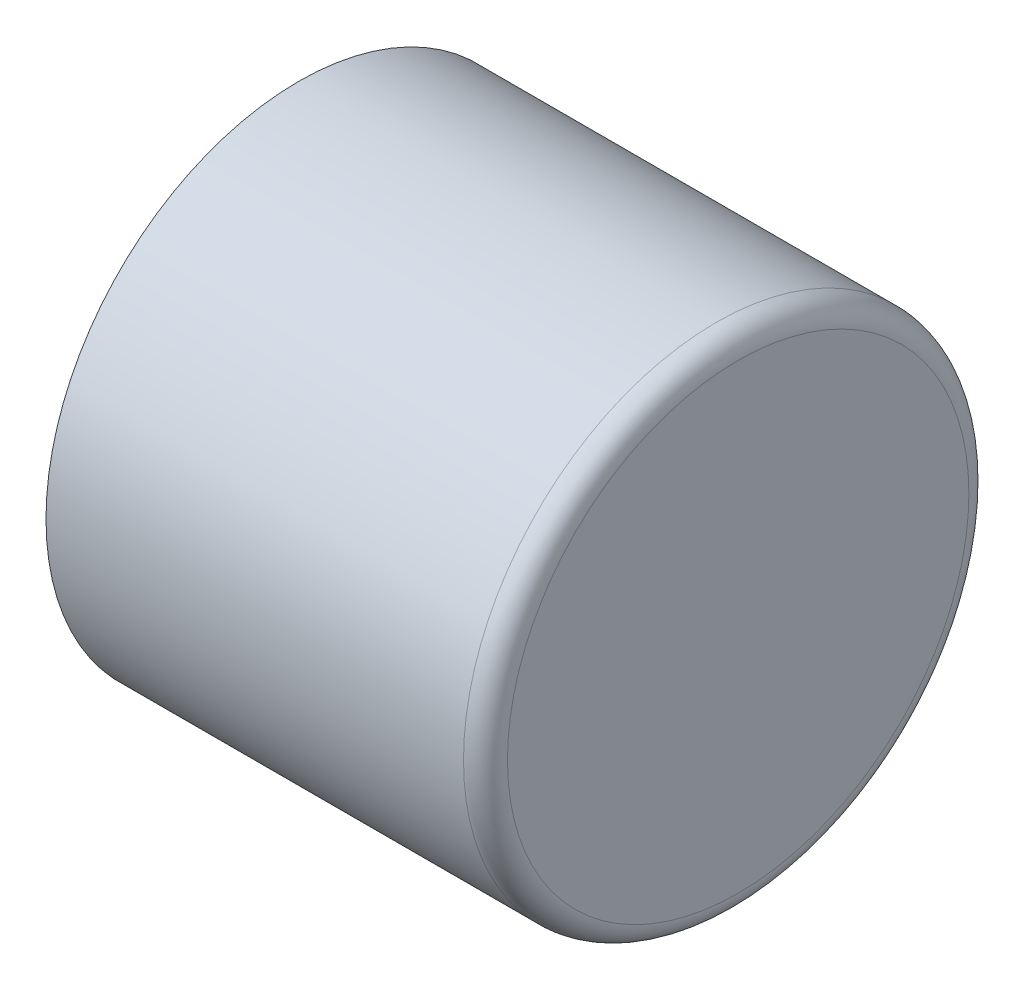
ISO-10303-21;
HEADER;
FILE_DESCRIPTION(('STEP AP214'),'2;1');
FILE_NAME('part.step','',(''),(''),'','','');
FILE_SCHEMA(('AUTOMOTIVE_DESIGN { 1 0 10303 214 1 1 1 1 }'));
ENDSEC;
DATA;
#1=APPLICATION_CONTEXT('core data for automotive mechanical design processes');
#2=APPLICATION_PROTOCOL_DEFINITION('international standard','automotive_design',2000,#1);
#3=PRODUCT_CONTEXT('',#1,'mechanical');
#4=PRODUCT('Part','Part','',(#3));
#5=PRODUCT_RELATED_PRODUCT_CATEGORY('part','',(#4));
#6=PRODUCT_DEFINITION_FORMATION('','',#4);
#7=PRODUCT_DEFINITION_CONTEXT('part definition',#1,'design');
#8=PRODUCT_DEFINITION('design','',#6,#7);
#9=PRODUCT_DEFINITION_SHAPE('','',#8);
#10=(LENGTH_UNIT() NAMED_UNIT(*) SI_UNIT(.MILLI.,.METRE.));
#11=(NAMED_UNIT(*) PLANE_ANGLE_UNIT() SI_UNIT($,.RADIAN.));
#12=(NAMED_UNIT(*) SI_UNIT($,.STERADIAN.) SOLID_ANGLE_UNIT());
#13=UNCERTAINTY_MEASURE_WITH_UNIT(LENGTH_MEASURE(1.E-05),#10,'distance_accuracy_value','');
#14=(GEOMETRIC_REPRESENTATION_CONTEXT(3) GLOBAL_UNCERTAINTY_ASSIGNED_CONTEXT((#13)) GLOBAL_UNIT_ASSIGNED_CONTEXT((#10,
#11,#12)) REPRESENTATION_CONTEXT('',''));
#15=CARTESIAN_POINT('',(0.,0.,0.));
#16=DIRECTION('',(0.,0.,1.));
#17=DIRECTION('',(1.,0.,0.));
#18=AXIS2_PLACEMENT_3D('',#15,#16,#17);
#19=CARTESIAN_POINT('',(25.4,0.,0.));
#20=DIRECTION('',(-1.,0.,0.));
#21=DIRECTION('',(0.,0.,1.));
#22=AXIS2_PLACEMENT_3D('',#19,#20,#21);
#23=CYLINDRICAL_SURFACE('',#22,12.7);
#24=CARTESIAN_POINT('',(0.,0.,0.));
#25=DIRECTION('',(1.,0.,0.));
#26=DIRECTION('',(0.,0.,-1.));
#27=AXIS2_PLACEMENT_3D('',#24,#25,#26);
#28=CIRCLE('',#27,12.7);
#29=CARTESIAN_POINT('',(0.,0.,-12.7));
#30=VERTEX_POINT('',#29);
#31=EDGE_CURVE('E55',#30,#30,#28,.T.);
#32=ORIENTED_EDGE('',*,*,#31,.F.);
#33=EDGE_LOOP('',(#32));
#34=FACE_BOUND('',#33,.T.);
#35=CARTESIAN_POINT('',(24.13,0.,0.));
#36=DIRECTION('',(1.,0.,0.));
#37=DIRECTION('',(0.,0.,-1.));
#38=AXIS2_PLACEMENT_3D('',#35,#36,#37);
#39=CIRCLE('',#38,12.7);
#40=CARTESIAN_POINT('',(24.13,0.,-12.7));
#41=VERTEX_POINT('',#40);
#42=EDGE_CURVE('E61',#41,#41,#39,.T.);
#43=ORIENTED_EDGE('',*,*,#42,.T.);
#44=EDGE_LOOP('',(#43));
#45=FACE_BOUND('',#44,.T.);
#46=ADVANCED_FACE('F37',(#34,#45),#23,.F.);
#47=CARTESIAN_POINT('',(25.4,0.,0.));
#48=DIRECTION('',(1.,0.,0.));
#49=DIRECTION('',(0.,0.,-1.));
#50=AXIS2_PLACEMENT_3D('',#47,#48,#49);
#51=PLANE('',#50);
#52=CARTESIAN_POINT('',(25.4,0.,0.));
#53=DIRECTION('',(1.,0.,0.));
#54=DIRECTION('',(0.,0.,-1.));
#55=AXIS2_PLACEMENT_3D('',#52,#53,#54);
#56=CIRCLE('',#55,13.335);
#57=CARTESIAN_POINT('',(25.4,0.,-13.335));
#58=VERTEX_POINT('',#57);
#59=EDGE_CURVE('E45',#58,#58,#56,.T.);
#60=ORIENTED_EDGE('',*,*,#59,.T.);
#61=EDGE_LOOP('',(#60));
#62=FACE_BOUND('',#61,.T.);
#63=ADVANCED_FACE('F77',(#62),#51,.T.);
#64=CARTESIAN_POINT('',(0.,0.,0.));
#65=DIRECTION('',(1.,0.,0.));
#66=DIRECTION('',(0.,0.,-1.));
#67=AXIS2_PLACEMENT_3D('',#64,#65,#66);
#68=PLANE('',#67);
#69=CARTESIAN_POINT('',(0.,0.,0.));
#70=DIRECTION('',(1.,0.,0.));
#71=DIRECTION('',(0.,0.,-1.));
#72=AXIS2_PLACEMENT_3D('',#69,#70,#71);
#73=CIRCLE('',#72,14.605);
#74=CARTESIAN_POINT('',(0.,0.,-14.605));
#75=VERTEX_POINT('',#74);
#76=EDGE_CURVE('E50',#75,#75,#73,.T.);
#77=ORIENTED_EDGE('',*,*,#76,.F.);
#78=EDGE_LOOP('',(#77));
#79=FACE_BOUND('',#78,.T.);
#80=ORIENTED_EDGE('',*,*,#31,.T.);
#81=EDGE_LOOP('',(#80));
#82=FACE_BOUND('',#81,.T.);
#83=ADVANCED_FACE('F82',(#79,#82),#68,.F.);
#84=CARTESIAN_POINT('',(25.4,0.,0.));
#85=DIRECTION('',(-1.,0.,0.));
#86=DIRECTION('',(0.,0.,1.));
#87=AXIS2_PLACEMENT_3D('',#84,#85,#86);
#88=CYLINDRICAL_SURFACE('',#87,14.605);
#89=CARTESIAN_POINT('',(24.13,0.,0.));
#90=DIRECTION('',(1.,0.,0.));
#91=DIRECTION('',(0.,0.,-1.));
#92=AXIS2_PLACEMENT_3D('',#89,#90,#91);
#93=CIRCLE('',#92,14.605);
#94=CARTESIAN_POINT('',(24.13,0.,-14.605));
#95=VERTEX_POINT('',#94);
#96=EDGE_CURVE('E10',#95,#95,#93,.F.);
#97=ORIENTED_EDGE('',*,*,#96,.T.);
#98=EDGE_LOOP('',(#97));
#99=FACE_BOUND('',#98,.T.);
#100=ORIENTED_EDGE('',*,*,#76,.T.);
#101=EDGE_LOOP('',(#100));
#102=FACE_BOUND('',#101,.T.);
#103=ADVANCED_FACE('F73',(#99,#102),#88,.T.);
#104=CARTESIAN_POINT('',(24.13,0.,0.));
#105=DIRECTION('',(1.,0.,0.));
#106=DIRECTION('',(0.,0.,-1.));
#107=AXIS2_PLACEMENT_3D('',#104,#105,#106);
#108=TOROIDAL_SURFACE('',#107,13.335,1.27);
#109=ORIENTED_EDGE('',*,*,#96,.F.);
#110=EDGE_LOOP('',(#109));
#111=FACE_BOUND('',#110,.T.);
#112=ORIENTED_EDGE('',*,*,#59,.F.);
#113=EDGE_LOOP('',(#112));
#114=FACE_BOUND('',#113,.T.);
#115=ADVANCED_FACE('F39',(#111,#114),#108,.T.);
#116=CARTESIAN_POINT('',(24.13,0.,0.));
#117=DIRECTION('',(1.,0.,0.));
#118=DIRECTION('',(0.,0.,-1.));
#119=AXIS2_PLACEMENT_3D('',#116,#117,#118);
#120=PLANE('',#119);
#121=ORIENTED_EDGE('',*,*,#42,.F.);
#122=EDGE_LOOP('',(#121));
#123=FACE_BOUND('',#122,.T.);
#124=ADVANCED_FACE('F67',(#123),#120,.F.);
#125=CLOSED_SHELL('',(#46,#63,#83,#103,#115,#124));
#126=MANIFOLD_SOLID_BREP('B2',#125);
#127=ADVANCED_BREP_SHAPE_REPRESENTATION('',(#18,#126),#14);
#128=SHAPE_DEFINITION_REPRESENTATION(#9,#127);
ENDSEC;
END-ISO-10303-21;
